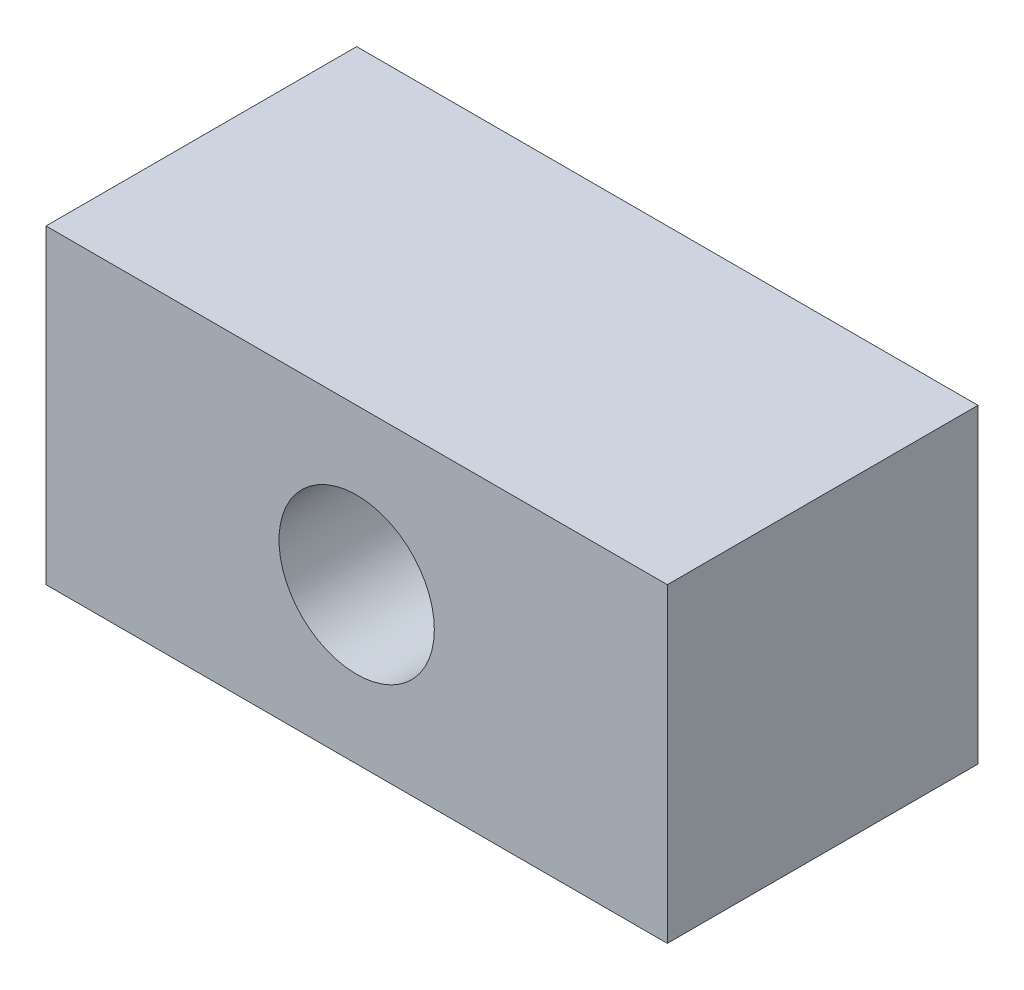
ISO-10303-21;
HEADER;
FILE_DESCRIPTION(('STEP AP214'),'2;1');
FILE_NAME('part.step','',(''),(''),'','','');
FILE_SCHEMA(('AUTOMOTIVE_DESIGN { 1 0 10303 214 1 1 1 1 }'));
ENDSEC;
DATA;
#1=APPLICATION_CONTEXT('core data for automotive mechanical design processes');
#2=APPLICATION_PROTOCOL_DEFINITION('international standard','automotive_design',2000,#1);
#3=PRODUCT_CONTEXT('',#1,'mechanical');
#4=PRODUCT('Part','Part','',(#3));
#5=PRODUCT_RELATED_PRODUCT_CATEGORY('part','',(#4));
#6=PRODUCT_DEFINITION_FORMATION('','',#4);
#7=PRODUCT_DEFINITION_CONTEXT('part definition',#1,'design');
#8=PRODUCT_DEFINITION('design','',#6,#7);
#9=PRODUCT_DEFINITION_SHAPE('','',#8);
#10=(LENGTH_UNIT() NAMED_UNIT(*) SI_UNIT(.MILLI.,.METRE.));
#11=(NAMED_UNIT(*) PLANE_ANGLE_UNIT() SI_UNIT($,.RADIAN.));
#12=(NAMED_UNIT(*) SI_UNIT($,.STERADIAN.) SOLID_ANGLE_UNIT());
#13=UNCERTAINTY_MEASURE_WITH_UNIT(LENGTH_MEASURE(1.E-05),#10,'distance_accuracy_value','');
#14=(GEOMETRIC_REPRESENTATION_CONTEXT(3) GLOBAL_UNCERTAINTY_ASSIGNED_CONTEXT((#13)) GLOBAL_UNIT_ASSIGNED_CONTEXT((#10,
#11,#12)) REPRESENTATION_CONTEXT('',''));
#15=CARTESIAN_POINT('',(0.,0.,0.));
#16=DIRECTION('',(0.,0.,1.));
#17=DIRECTION('',(1.,0.,0.));
#18=AXIS2_PLACEMENT_3D('',#15,#16,#17);
#19=CARTESIAN_POINT('',(0.,0.,30.));
#20=DIRECTION('',(0.,0.,-1.));
#21=DIRECTION('',(-1.,0.,0.));
#22=AXIS2_PLACEMENT_3D('',#19,#20,#21);
#23=PLANE('',#22);
#24=DIRECTION('',(0.,1.,0.));
#25=VECTOR('',#24,1.);
#26=CARTESIAN_POINT('',(30.,-15.,30.));
#27=LINE('',#26,#25);
#28=CARTESIAN_POINT('',(30.,-15.,30.));
#29=VERTEX_POINT('',#28);
#30=CARTESIAN_POINT('',(30.,15.,30.));
#31=VERTEX_POINT('',#30);
#32=EDGE_CURVE('E92',#29,#31,#27,.T.);
#33=ORIENTED_EDGE('',*,*,#32,.T.);
#34=DIRECTION('',(-1.,0.,0.));
#35=VECTOR('',#34,1.);
#36=CARTESIAN_POINT('',(-30.,15.,30.));
#37=LINE('',#36,#35);
#38=CARTESIAN_POINT('',(-30.,15.,30.));
#39=VERTEX_POINT('',#38);
#40=EDGE_CURVE('E87',#31,#39,#37,.T.);
#41=ORIENTED_EDGE('',*,*,#40,.T.);
#42=DIRECTION('',(0.,-1.,0.));
#43=VECTOR('',#42,1.);
#44=CARTESIAN_POINT('',(-30.,-15.,30.));
#45=LINE('',#44,#43);
#46=CARTESIAN_POINT('',(-30.,-15.,30.));
#47=VERTEX_POINT('',#46);
#48=EDGE_CURVE('E90',#39,#47,#45,.T.);
#49=ORIENTED_EDGE('',*,*,#48,.T.);
#50=DIRECTION('',(1.,0.,0.));
#51=VECTOR('',#50,1.);
#52=CARTESIAN_POINT('',(-30.,-15.,30.));
#53=LINE('',#52,#51);
#54=EDGE_CURVE('E57',#47,#29,#53,.T.);
#55=ORIENTED_EDGE('',*,*,#54,.T.);
#56=EDGE_LOOP('',(#33,#41,#49,#55));
#57=FACE_BOUND('',#56,.T.);
#58=CARTESIAN_POINT('',(0.,0.,30.));
#59=DIRECTION('',(0.,0.,1.));
#60=DIRECTION('',(1.,0.,0.));
#61=AXIS2_PLACEMENT_3D('',#58,#59,#60);
#62=CIRCLE('',#61,7.5);
#63=CARTESIAN_POINT('',(7.49999999999999,0.,30.));
#64=VERTEX_POINT('',#63);
#65=EDGE_CURVE('E112',#64,#64,#62,.T.);
#66=ORIENTED_EDGE('',*,*,#65,.F.);
#67=EDGE_LOOP('',(#66));
#68=FACE_BOUND('',#67,.T.);
#69=ADVANCED_FACE('F39',(#57,#68),#23,.F.);
#70=CARTESIAN_POINT('',(0.,0.,0.));
#71=DIRECTION('',(0.,0.,-1.));
#72=DIRECTION('',(-1.,0.,0.));
#73=AXIS2_PLACEMENT_3D('',#70,#71,#72);
#74=PLANE('',#73);
#75=DIRECTION('',(0.,1.,0.));
#76=VECTOR('',#75,1.);
#77=CARTESIAN_POINT('',(30.,-15.,0.));
#78=LINE('',#77,#76);
#79=CARTESIAN_POINT('',(30.,-15.,0.));
#80=VERTEX_POINT('',#79);
#81=CARTESIAN_POINT('',(30.,15.,0.));
#82=VERTEX_POINT('',#81);
#83=EDGE_CURVE('E108',#80,#82,#78,.T.);
#84=ORIENTED_EDGE('',*,*,#83,.F.);
#85=DIRECTION('',(1.,0.,0.));
#86=VECTOR('',#85,1.);
#87=CARTESIAN_POINT('',(-30.,-15.,0.));
#88=LINE('',#87,#86);
#89=CARTESIAN_POINT('',(-30.,-15.,0.));
#90=VERTEX_POINT('',#89);
#91=EDGE_CURVE('E80',#90,#80,#88,.T.);
#92=ORIENTED_EDGE('',*,*,#91,.F.);
#93=DIRECTION('',(0.,-1.,0.));
#94=VECTOR('',#93,1.);
#95=CARTESIAN_POINT('',(-30.,-15.,0.));
#96=LINE('',#95,#94);
#97=CARTESIAN_POINT('',(-30.,15.,0.));
#98=VERTEX_POINT('',#97);
#99=EDGE_CURVE('E74',#98,#90,#96,.T.);
#100=ORIENTED_EDGE('',*,*,#99,.F.);
#101=DIRECTION('',(-1.,0.,0.));
#102=VECTOR('',#101,1.);
#103=CARTESIAN_POINT('',(-30.,15.,0.));
#104=LINE('',#103,#102);
#105=EDGE_CURVE('E97',#82,#98,#104,.T.);
#106=ORIENTED_EDGE('',*,*,#105,.F.);
#107=EDGE_LOOP('',(#84,#92,#100,#106));
#108=FACE_BOUND('',#107,.T.);
#109=CARTESIAN_POINT('',(0.,0.,0.));
#110=DIRECTION('',(0.,0.,1.));
#111=DIRECTION('',(1.,0.,0.));
#112=AXIS2_PLACEMENT_3D('',#109,#110,#111);
#113=CIRCLE('',#112,7.5);
#114=CARTESIAN_POINT('',(7.49999999999999,0.,0.));
#115=VERTEX_POINT('',#114);
#116=EDGE_CURVE('E130',#115,#115,#113,.T.);
#117=ORIENTED_EDGE('',*,*,#116,.T.);
#118=EDGE_LOOP('',(#117));
#119=FACE_BOUND('',#118,.T.);
#120=ADVANCED_FACE('F125',(#108,#119),#74,.T.);
#121=CARTESIAN_POINT('',(30.,-15.,30.));
#122=DIRECTION('',(-1.,0.,0.));
#123=DIRECTION('',(0.,0.,1.));
#124=AXIS2_PLACEMENT_3D('',#121,#122,#123);
#125=PLANE('',#124);
#126=ORIENTED_EDGE('',*,*,#83,.T.);
#127=DIRECTION('',(0.,0.,-1.));
#128=VECTOR('',#127,1.);
#129=CARTESIAN_POINT('',(30.,15.,30.));
#130=LINE('',#129,#128);
#131=EDGE_CURVE('E11',#31,#82,#130,.T.);
#132=ORIENTED_EDGE('',*,*,#131,.F.);
#133=ORIENTED_EDGE('',*,*,#32,.F.);
#134=DIRECTION('',(0.,0.,-1.));
#135=VECTOR('',#134,1.);
#136=CARTESIAN_POINT('',(30.,-15.,30.));
#137=LINE('',#136,#135);
#138=EDGE_CURVE('E104',#29,#80,#137,.T.);
#139=ORIENTED_EDGE('',*,*,#138,.T.);
#140=EDGE_LOOP('',(#126,#132,#133,#139));
#141=FACE_BOUND('',#140,.T.);
#142=ADVANCED_FACE('F41',(#141),#125,.F.);
#143=CARTESIAN_POINT('',(-30.,15.,30.));
#144=DIRECTION('',(0.,-1.,0.));
#145=DIRECTION('',(0.,0.,-1.));
#146=AXIS2_PLACEMENT_3D('',#143,#144,#145);
#147=PLANE('',#146);
#148=ORIENTED_EDGE('',*,*,#105,.T.);
#149=DIRECTION('',(0.,0.,-1.));
#150=VECTOR('',#149,1.);
#151=CARTESIAN_POINT('',(-30.,15.,30.));
#152=LINE('',#151,#150);
#153=EDGE_CURVE('E49',#39,#98,#152,.T.);
#154=ORIENTED_EDGE('',*,*,#153,.F.);
#155=ORIENTED_EDGE('',*,*,#40,.F.);
#156=ORIENTED_EDGE('',*,*,#131,.T.);
#157=EDGE_LOOP('',(#148,#154,#155,#156));
#158=FACE_BOUND('',#157,.T.);
#159=ADVANCED_FACE('F96',(#158),#147,.F.);
#160=CARTESIAN_POINT('',(-30.,-15.,30.));
#161=DIRECTION('',(1.,0.,0.));
#162=DIRECTION('',(0.,0.,-1.));
#163=AXIS2_PLACEMENT_3D('',#160,#161,#162);
#164=PLANE('',#163);
#165=ORIENTED_EDGE('',*,*,#99,.T.);
#166=DIRECTION('',(0.,0.,-1.));
#167=VECTOR('',#166,1.);
#168=CARTESIAN_POINT('',(-30.,-15.,30.));
#169=LINE('',#168,#167);
#170=EDGE_CURVE('E99',#47,#90,#169,.T.);
#171=ORIENTED_EDGE('',*,*,#170,.F.);
#172=ORIENTED_EDGE('',*,*,#48,.F.);
#173=ORIENTED_EDGE('',*,*,#153,.T.);
#174=EDGE_LOOP('',(#165,#171,#172,#173));
#175=FACE_BOUND('',#174,.T.);
#176=ADVANCED_FACE('F100',(#175),#164,.F.);
#177=CARTESIAN_POINT('',(-30.,-15.,30.));
#178=DIRECTION('',(0.,1.,0.));
#179=DIRECTION('',(0.,0.,1.));
#180=AXIS2_PLACEMENT_3D('',#177,#178,#179);
#181=PLANE('',#180);
#182=ORIENTED_EDGE('',*,*,#91,.T.);
#183=ORIENTED_EDGE('',*,*,#138,.F.);
#184=ORIENTED_EDGE('',*,*,#54,.F.);
#185=ORIENTED_EDGE('',*,*,#170,.T.);
#186=EDGE_LOOP('',(#182,#183,#184,#185));
#187=FACE_BOUND('',#186,.T.);
#188=ADVANCED_FACE('F122',(#187),#181,.F.);
#189=CARTESIAN_POINT('',(0.,0.,30.));
#190=DIRECTION('',(0.,0.,-1.));
#191=DIRECTION('',(-1.,0.,0.));
#192=AXIS2_PLACEMENT_3D('',#189,#190,#191);
#193=CYLINDRICAL_SURFACE('',#192,7.5);
#194=ORIENTED_EDGE('',*,*,#65,.T.);
#195=EDGE_LOOP('',(#194));
#196=FACE_BOUND('',#195,.T.);
#197=ORIENTED_EDGE('',*,*,#116,.F.);
#198=EDGE_LOOP('',(#197));
#199=FACE_BOUND('',#198,.T.);
#200=ADVANCED_FACE('F138',(#196,#199),#193,.F.);
#201=CLOSED_SHELL('',(#69,#120,#142,#159,#176,#188,#200));
#202=MANIFOLD_SOLID_BREP('B2',#201);
#203=ADVANCED_BREP_SHAPE_REPRESENTATION('',(#18,#202),#14);
#204=SHAPE_DEFINITION_REPRESENTATION(#9,#203);
ENDSEC;
END-ISO-10303-21;
